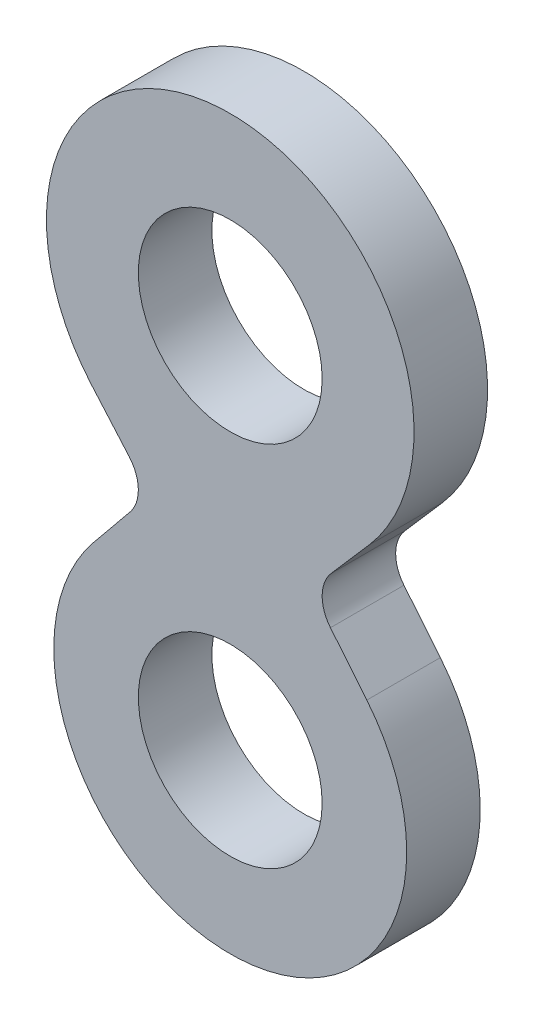
ISO-10303-21;
HEADER;
FILE_DESCRIPTION(('STEP AP214'),'2;1');
FILE_NAME('part.step','',(''),(''),'','','');
FILE_SCHEMA(('AUTOMOTIVE_DESIGN { 1 0 10303 214 1 1 1 1 }'));
ENDSEC;
DATA;
#1=APPLICATION_CONTEXT('core data for automotive mechanical design processes');
#2=APPLICATION_PROTOCOL_DEFINITION('international standard','automotive_design',2000,#1);
#3=PRODUCT_CONTEXT('',#1,'mechanical');
#4=PRODUCT('Part','Part','',(#3));
#5=PRODUCT_RELATED_PRODUCT_CATEGORY('part','',(#4));
#6=PRODUCT_DEFINITION_FORMATION('','',#4);
#7=PRODUCT_DEFINITION_CONTEXT('part definition',#1,'design');
#8=PRODUCT_DEFINITION('design','',#6,#7);
#9=PRODUCT_DEFINITION_SHAPE('','',#8);
#10=(LENGTH_UNIT() NAMED_UNIT(*) SI_UNIT(.MILLI.,.METRE.));
#11=(NAMED_UNIT(*) PLANE_ANGLE_UNIT() SI_UNIT($,.RADIAN.));
#12=(NAMED_UNIT(*) SI_UNIT($,.STERADIAN.) SOLID_ANGLE_UNIT());
#13=UNCERTAINTY_MEASURE_WITH_UNIT(LENGTH_MEASURE(1.E-05),#10,'distance_accuracy_value','');
#14=(GEOMETRIC_REPRESENTATION_CONTEXT(3) GLOBAL_UNCERTAINTY_ASSIGNED_CONTEXT((#13)) GLOBAL_UNIT_ASSIGNED_CONTEXT((#10,
#11,#12)) REPRESENTATION_CONTEXT('',''));
#15=CARTESIAN_POINT('',(0.,0.,0.));
#16=DIRECTION('',(0.,0.,1.));
#17=DIRECTION('',(1.,0.,0.));
#18=AXIS2_PLACEMENT_3D('',#15,#16,#17);
#19=CARTESIAN_POINT('',(0.,0.,12.7));
#20=DIRECTION('',(0.,0.,1.));
#21=DIRECTION('',(1.,0.,0.));
#22=AXIS2_PLACEMENT_3D('',#19,#20,#21);
#23=PLANE('',#22);
#24=CARTESIAN_POINT('',(0.,0.,12.7));
#25=DIRECTION('',(0.,0.,1.));
#26=DIRECTION('',(1.,0.,0.));
#27=AXIS2_PLACEMENT_3D('',#24,#25,#26);
#28=CIRCLE('',#27,15.875);
#29=CARTESIAN_POINT('',(15.875,0.,12.7));
#30=VERTEX_POINT('',#29);
#31=EDGE_CURVE('E140',#30,#30,#28,.T.);
#32=ORIENTED_EDGE('',*,*,#31,.F.);
#33=EDGE_LOOP('',(#32));
#34=FACE_BOUND('',#33,.T.);
#35=CARTESIAN_POINT('',(0.,0.,12.7));
#36=DIRECTION('',(0.,0.,1.));
#37=DIRECTION('',(1.,0.,0.));
#38=AXIS2_PLACEMENT_3D('',#35,#36,#37);
#39=CIRCLE('',#38,30.48);
#40=CARTESIAN_POINT('',(-23.5941386806436,19.2962954972854,12.7));
#41=VERTEX_POINT('',#40);
#42=CARTESIAN_POINT('',(23.5941386806436,19.2962954972854,12.7));
#43=VERTEX_POINT('',#42);
#44=EDGE_CURVE('E151',#41,#43,#39,.T.);
#45=ORIENTED_EDGE('',*,*,#44,.T.);
#46=DIRECTION('',(-0.633080560934561,0.774085914719278,0.));
#47=VECTOR('',#46,1.);
#48=CARTESIAN_POINT('',(17.3095544415326,26.9806384380655,12.7));
#49=LINE('',#48,#47);
#50=CARTESIAN_POINT('',(17.3095544415326,26.9806384380655,12.7));
#51=VERTEX_POINT('',#50);
#52=EDGE_CURVE('E99',#43,#51,#49,.T.);
#53=ORIENTED_EDGE('',*,*,#52,.T.);
#54=CARTESIAN_POINT('',(22.225,31.0007,12.7));
#55=DIRECTION('',(0.,0.,-1.));
#56=DIRECTION('',(1.,0.,0.));
#57=AXIS2_PLACEMENT_3D('',#54,#55,#56);
#58=CIRCLE('',#57,6.35);
#59=CARTESIAN_POINT('',(17.4347415045666,35.1691437799889,12.7));
#60=VERTEX_POINT('',#59);
#61=EDGE_CURVE('E166',#51,#60,#58,.T.);
#62=ORIENTED_EDGE('',*,*,#61,.T.);
#63=DIRECTION('',(0.656447839368324,0.754371416603691,0.));
#64=VECTOR('',#63,1.);
#65=CARTESIAN_POINT('',(17.4347415045666,35.1691437799889,12.7));
#66=LINE('',#65,#64);
#67=CARTESIAN_POINT('',(23.9512924771672,42.6577811000557,12.7));
#68=VERTEX_POINT('',#67);
#69=EDGE_CURVE('E179',#60,#68,#66,.T.);
#70=ORIENTED_EDGE('',*,*,#69,.T.);
#71=CARTESIAN_POINT('',(0.,63.5,12.7));
#72=DIRECTION('',(0.,0.,1.));
#73=DIRECTION('',(1.,0.,0.));
#74=AXIS2_PLACEMENT_3D('',#71,#72,#73);
#75=CIRCLE('',#74,31.75);
#76=CARTESIAN_POINT('',(-23.9512924771672,42.6577811000557,12.7));
#77=VERTEX_POINT('',#76);
#78=EDGE_CURVE('E118',#68,#77,#75,.T.);
#79=ORIENTED_EDGE('',*,*,#78,.T.);
#80=DIRECTION('',(0.656447839368324,-0.754371416603691,0.));
#81=VECTOR('',#80,1.);
#82=CARTESIAN_POINT('',(-17.4347415045666,35.1691437799889,12.7));
#83=LINE('',#82,#81);
#84=CARTESIAN_POINT('',(-17.4347415045666,35.1691437799889,12.7));
#85=VERTEX_POINT('',#84);
#86=EDGE_CURVE('E112',#77,#85,#83,.T.);
#87=ORIENTED_EDGE('',*,*,#86,.T.);
#88=CARTESIAN_POINT('',(-22.225,31.0007,12.7));
#89=DIRECTION('',(0.,0.,-1.));
#90=DIRECTION('',(1.,0.,0.));
#91=AXIS2_PLACEMENT_3D('',#88,#89,#90);
#92=CIRCLE('',#91,6.35);
#93=CARTESIAN_POINT('',(-17.3095544415326,26.9806384380655,12.7));
#94=VERTEX_POINT('',#93);
#95=EDGE_CURVE('E116',#85,#94,#92,.T.);
#96=ORIENTED_EDGE('',*,*,#95,.T.);
#97=DIRECTION('',(-0.633080560934561,-0.774085914719278,0.));
#98=VECTOR('',#97,1.);
#99=CARTESIAN_POINT('',(-23.5941386806436,19.2962954972854,12.7));
#100=LINE('',#99,#98);
#101=EDGE_CURVE('E56',#94,#41,#100,.T.);
#102=ORIENTED_EDGE('',*,*,#101,.T.);
#103=EDGE_LOOP('',(#45,#53,#62,#70,#79,#87,#96,#102));
#104=FACE_BOUND('',#103,.T.);
#105=CARTESIAN_POINT('',(0.,63.5,12.7));
#106=DIRECTION('',(0.,0.,1.));
#107=DIRECTION('',(1.,0.,0.));
#108=AXIS2_PLACEMENT_3D('',#105,#106,#107);
#109=CIRCLE('',#108,15.875);
#110=CARTESIAN_POINT('',(15.875,63.5,12.7));
#111=VERTEX_POINT('',#110);
#112=EDGE_CURVE('E188',#111,#111,#109,.T.);
#113=ORIENTED_EDGE('',*,*,#112,.F.);
#114=EDGE_LOOP('',(#113));
#115=FACE_BOUND('',#114,.T.);
#116=ADVANCED_FACE('F39',(#34,#104,#115),#23,.T.);
#117=CARTESIAN_POINT('',(0.,0.,0.));
#118=DIRECTION('',(0.,0.,1.));
#119=DIRECTION('',(1.,0.,0.));
#120=AXIS2_PLACEMENT_3D('',#117,#118,#119);
#121=PLANE('',#120);
#122=CARTESIAN_POINT('',(0.,0.,0.));
#123=DIRECTION('',(0.,0.,1.));
#124=DIRECTION('',(1.,0.,0.));
#125=AXIS2_PLACEMENT_3D('',#122,#123,#124);
#126=CIRCLE('',#125,30.48);
#127=CARTESIAN_POINT('',(-23.5941386806436,19.2962954972854,0.));
#128=VERTEX_POINT('',#127);
#129=CARTESIAN_POINT('',(23.5941386806436,19.2962954972854,0.));
#130=VERTEX_POINT('',#129);
#131=EDGE_CURVE('E136',#128,#130,#126,.T.);
#132=ORIENTED_EDGE('',*,*,#131,.F.);
#133=DIRECTION('',(-0.633080560934561,-0.774085914719278,0.));
#134=VECTOR('',#133,1.);
#135=CARTESIAN_POINT('',(-23.5941386806436,19.2962954972854,0.));
#136=LINE('',#135,#134);
#137=CARTESIAN_POINT('',(-17.3095544415326,26.9806384380655,0.));
#138=VERTEX_POINT('',#137);
#139=EDGE_CURVE('E91',#138,#128,#136,.T.);
#140=ORIENTED_EDGE('',*,*,#139,.F.);
#141=CARTESIAN_POINT('',(-22.225,31.0007,0.));
#142=DIRECTION('',(0.,0.,-1.));
#143=DIRECTION('',(1.,0.,0.));
#144=AXIS2_PLACEMENT_3D('',#141,#142,#143);
#145=CIRCLE('',#144,6.35);
#146=CARTESIAN_POINT('',(-17.4347415045666,35.1691437799889,0.));
#147=VERTEX_POINT('',#146);
#148=EDGE_CURVE('E85',#147,#138,#145,.T.);
#149=ORIENTED_EDGE('',*,*,#148,.F.);
#150=DIRECTION('',(0.656447839368324,-0.754371416603691,0.));
#151=VECTOR('',#150,1.);
#152=CARTESIAN_POINT('',(-17.4347415045666,35.1691437799889,0.));
#153=LINE('',#152,#151);
#154=CARTESIAN_POINT('',(-23.9512924771672,42.6577811000557,0.));
#155=VERTEX_POINT('',#154);
#156=EDGE_CURVE('E126',#155,#147,#153,.T.);
#157=ORIENTED_EDGE('',*,*,#156,.F.);
#158=CARTESIAN_POINT('',(0.,63.5,0.));
#159=DIRECTION('',(0.,0.,1.));
#160=DIRECTION('',(1.,0.,0.));
#161=AXIS2_PLACEMENT_3D('',#158,#159,#160);
#162=CIRCLE('',#161,31.75);
#163=CARTESIAN_POINT('',(23.9512924771672,42.6577811000557,0.));
#164=VERTEX_POINT('',#163);
#165=EDGE_CURVE('E146',#164,#155,#162,.T.);
#166=ORIENTED_EDGE('',*,*,#165,.F.);
#167=DIRECTION('',(0.656447839368324,0.754371416603691,0.));
#168=VECTOR('',#167,1.);
#169=CARTESIAN_POINT('',(17.4347415045666,35.1691437799889,0.));
#170=LINE('',#169,#168);
#171=CARTESIAN_POINT('',(17.4347415045666,35.1691437799889,0.));
#172=VERTEX_POINT('',#171);
#173=EDGE_CURVE('E144',#172,#164,#170,.T.);
#174=ORIENTED_EDGE('',*,*,#173,.F.);
#175=CARTESIAN_POINT('',(22.225,31.0007,0.));
#176=DIRECTION('',(0.,0.,-1.));
#177=DIRECTION('',(1.,0.,0.));
#178=AXIS2_PLACEMENT_3D('',#175,#176,#177);
#179=CIRCLE('',#178,6.35);
#180=CARTESIAN_POINT('',(17.3095544415326,26.9806384380655,0.));
#181=VERTEX_POINT('',#180);
#182=EDGE_CURVE('E142',#181,#172,#179,.T.);
#183=ORIENTED_EDGE('',*,*,#182,.F.);
#184=DIRECTION('',(-0.633080560934561,0.774085914719278,0.));
#185=VECTOR('',#184,1.);
#186=CARTESIAN_POINT('',(17.3095544415326,26.9806384380655,0.));
#187=LINE('',#186,#185);
#188=EDGE_CURVE('E139',#130,#181,#187,.T.);
#189=ORIENTED_EDGE('',*,*,#188,.F.);
#190=EDGE_LOOP('',(#132,#140,#149,#157,#166,#174,#183,#189));
#191=FACE_BOUND('',#190,.T.);
#192=CARTESIAN_POINT('',(0.,0.,0.));
#193=DIRECTION('',(0.,0.,1.));
#194=DIRECTION('',(1.,0.,0.));
#195=AXIS2_PLACEMENT_3D('',#192,#193,#194);
#196=CIRCLE('',#195,15.875);
#197=CARTESIAN_POINT('',(15.875,0.,0.));
#198=VERTEX_POINT('',#197);
#199=EDGE_CURVE('E185',#198,#198,#196,.T.);
#200=ORIENTED_EDGE('',*,*,#199,.T.);
#201=EDGE_LOOP('',(#200));
#202=FACE_BOUND('',#201,.T.);
#203=CARTESIAN_POINT('',(0.,63.5,0.));
#204=DIRECTION('',(0.,0.,1.));
#205=DIRECTION('',(1.,0.,0.));
#206=AXIS2_PLACEMENT_3D('',#203,#204,#205);
#207=CIRCLE('',#206,15.875);
#208=CARTESIAN_POINT('',(15.875,63.5,0.));
#209=VERTEX_POINT('',#208);
#210=EDGE_CURVE('E191',#209,#209,#207,.T.);
#211=ORIENTED_EDGE('',*,*,#210,.T.);
#212=EDGE_LOOP('',(#211));
#213=FACE_BOUND('',#212,.T.);
#214=ADVANCED_FACE('F170',(#191,#202,#213),#121,.F.);
#215=CARTESIAN_POINT('',(0.,0.,12.7));
#216=DIRECTION('',(0.,0.,-1.));
#217=DIRECTION('',(-1.,0.,0.));
#218=AXIS2_PLACEMENT_3D('',#215,#216,#217);
#219=CYLINDRICAL_SURFACE('',#218,30.48);
#220=ORIENTED_EDGE('',*,*,#131,.T.);
#221=DIRECTION('',(0.,0.,-1.));
#222=VECTOR('',#221,1.);
#223=CARTESIAN_POINT('',(23.5941386806436,19.2962954972854,12.7));
#224=LINE('',#223,#222);
#225=EDGE_CURVE('E11',#43,#130,#224,.T.);
#226=ORIENTED_EDGE('',*,*,#225,.F.);
#227=ORIENTED_EDGE('',*,*,#44,.F.);
#228=DIRECTION('',(0.,0.,-1.));
#229=VECTOR('',#228,1.);
#230=CARTESIAN_POINT('',(-23.5941386806436,19.2962954972854,12.7));
#231=LINE('',#230,#229);
#232=EDGE_CURVE('E132',#41,#128,#231,.T.);
#233=ORIENTED_EDGE('',*,*,#232,.T.);
#234=EDGE_LOOP('',(#220,#226,#227,#233));
#235=FACE_BOUND('',#234,.T.);
#236=ADVANCED_FACE('F41',(#235),#219,.T.);
#237=CARTESIAN_POINT('',(17.3095544415326,26.9806384380655,12.7));
#238=DIRECTION('',(-0.774085914719278,-0.633080560934561,0.));
#239=DIRECTION('',(0.633080560934561,-0.774085914719278,0.));
#240=AXIS2_PLACEMENT_3D('',#237,#238,#239);
#241=PLANE('',#240);
#242=ORIENTED_EDGE('',*,*,#188,.T.);
#243=DIRECTION('',(0.,0.,-1.));
#244=VECTOR('',#243,1.);
#245=CARTESIAN_POINT('',(17.3095544415326,26.9806384380655,12.7));
#246=LINE('',#245,#244);
#247=EDGE_CURVE('E48',#51,#181,#246,.T.);
#248=ORIENTED_EDGE('',*,*,#247,.F.);
#249=ORIENTED_EDGE('',*,*,#52,.F.);
#250=ORIENTED_EDGE('',*,*,#225,.T.);
#251=EDGE_LOOP('',(#242,#248,#249,#250));
#252=FACE_BOUND('',#251,.T.);
#253=ADVANCED_FACE('F223',(#252),#241,.F.);
#254=CARTESIAN_POINT('',(22.225,31.0007,12.7));
#255=DIRECTION('',(0.,0.,-1.));
#256=DIRECTION('',(-1.,0.,0.));
#257=AXIS2_PLACEMENT_3D('',#254,#255,#256);
#258=CYLINDRICAL_SURFACE('',#257,6.35);
#259=ORIENTED_EDGE('',*,*,#182,.T.);
#260=DIRECTION('',(0.,0.,-1.));
#261=VECTOR('',#260,1.);
#262=CARTESIAN_POINT('',(17.4347415045666,35.1691437799889,12.7));
#263=LINE('',#262,#261);
#264=EDGE_CURVE('E158',#60,#172,#263,.T.);
#265=ORIENTED_EDGE('',*,*,#264,.F.);
#266=ORIENTED_EDGE('',*,*,#61,.F.);
#267=ORIENTED_EDGE('',*,*,#247,.T.);
#268=EDGE_LOOP('',(#259,#265,#266,#267));
#269=FACE_BOUND('',#268,.T.);
#270=ADVANCED_FACE('F164',(#269),#258,.F.);
#271=CARTESIAN_POINT('',(17.4347415045666,35.1691437799889,12.7));
#272=DIRECTION('',(-0.754371416603691,0.656447839368324,0.));
#273=DIRECTION('',(-0.656447839368324,-0.754371416603691,0.));
#274=AXIS2_PLACEMENT_3D('',#271,#272,#273);
#275=PLANE('',#274);
#276=ORIENTED_EDGE('',*,*,#173,.T.);
#277=DIRECTION('',(0.,0.,-1.));
#278=VECTOR('',#277,1.);
#279=CARTESIAN_POINT('',(23.9512924771672,42.6577811000557,12.7));
#280=LINE('',#279,#278);
#281=EDGE_CURVE('E155',#68,#164,#280,.T.);
#282=ORIENTED_EDGE('',*,*,#281,.F.);
#283=ORIENTED_EDGE('',*,*,#69,.F.);
#284=ORIENTED_EDGE('',*,*,#264,.T.);
#285=EDGE_LOOP('',(#276,#282,#283,#284));
#286=FACE_BOUND('',#285,.T.);
#287=ADVANCED_FACE('F175',(#286),#275,.F.);
#288=CARTESIAN_POINT('',(0.,63.5,12.7));
#289=DIRECTION('',(0.,0.,-1.));
#290=DIRECTION('',(-1.,0.,0.));
#291=AXIS2_PLACEMENT_3D('',#288,#289,#290);
#292=CYLINDRICAL_SURFACE('',#291,31.75);
#293=ORIENTED_EDGE('',*,*,#165,.T.);
#294=DIRECTION('',(0.,0.,-1.));
#295=VECTOR('',#294,1.);
#296=CARTESIAN_POINT('',(-23.9512924771672,42.6577811000557,12.7));
#297=LINE('',#296,#295);
#298=EDGE_CURVE('E127',#77,#155,#297,.T.);
#299=ORIENTED_EDGE('',*,*,#298,.F.);
#300=ORIENTED_EDGE('',*,*,#78,.F.);
#301=ORIENTED_EDGE('',*,*,#281,.T.);
#302=EDGE_LOOP('',(#293,#299,#300,#301));
#303=FACE_BOUND('',#302,.T.);
#304=ADVANCED_FACE('F178',(#303),#292,.T.);
#305=CARTESIAN_POINT('',(-17.4347415045666,35.1691437799889,12.7));
#306=DIRECTION('',(0.754371416603691,0.656447839368324,0.));
#307=DIRECTION('',(-0.656447839368324,0.754371416603691,0.));
#308=AXIS2_PLACEMENT_3D('',#305,#306,#307);
#309=PLANE('',#308);
#310=ORIENTED_EDGE('',*,*,#156,.T.);
#311=DIRECTION('',(0.,0.,-1.));
#312=VECTOR('',#311,1.);
#313=CARTESIAN_POINT('',(-17.4347415045666,35.1691437799889,12.7));
#314=LINE('',#313,#312);
#315=EDGE_CURVE('E123',#85,#147,#314,.T.);
#316=ORIENTED_EDGE('',*,*,#315,.F.);
#317=ORIENTED_EDGE('',*,*,#86,.F.);
#318=ORIENTED_EDGE('',*,*,#298,.T.);
#319=EDGE_LOOP('',(#310,#316,#317,#318));
#320=FACE_BOUND('',#319,.T.);
#321=ADVANCED_FACE('F124',(#320),#309,.F.);
#322=CARTESIAN_POINT('',(-22.225,31.0007,12.7));
#323=DIRECTION('',(0.,0.,-1.));
#324=DIRECTION('',(-1.,0.,0.));
#325=AXIS2_PLACEMENT_3D('',#322,#323,#324);
#326=CYLINDRICAL_SURFACE('',#325,6.35);
#327=ORIENTED_EDGE('',*,*,#148,.T.);
#328=DIRECTION('',(0.,0.,-1.));
#329=VECTOR('',#328,1.);
#330=CARTESIAN_POINT('',(-17.3095544415326,26.9806384380655,12.7));
#331=LINE('',#330,#329);
#332=EDGE_CURVE('E128',#94,#138,#331,.T.);
#333=ORIENTED_EDGE('',*,*,#332,.F.);
#334=ORIENTED_EDGE('',*,*,#95,.F.);
#335=ORIENTED_EDGE('',*,*,#315,.T.);
#336=EDGE_LOOP('',(#327,#333,#334,#335));
#337=FACE_BOUND('',#336,.T.);
#338=ADVANCED_FACE('F130',(#337),#326,.F.);
#339=CARTESIAN_POINT('',(-23.5941386806436,19.2962954972854,12.7));
#340=DIRECTION('',(0.774085914719278,-0.633080560934561,0.));
#341=DIRECTION('',(0.633080560934561,0.774085914719278,0.));
#342=AXIS2_PLACEMENT_3D('',#339,#340,#341);
#343=PLANE('',#342);
#344=ORIENTED_EDGE('',*,*,#139,.T.);
#345=ORIENTED_EDGE('',*,*,#232,.F.);
#346=ORIENTED_EDGE('',*,*,#101,.F.);
#347=ORIENTED_EDGE('',*,*,#332,.T.);
#348=EDGE_LOOP('',(#344,#345,#346,#347));
#349=FACE_BOUND('',#348,.T.);
#350=ADVANCED_FACE('F211',(#349),#343,.F.);
#351=CARTESIAN_POINT('',(0.,0.,12.7));
#352=DIRECTION('',(0.,0.,-1.));
#353=DIRECTION('',(-1.,0.,0.));
#354=AXIS2_PLACEMENT_3D('',#351,#352,#353);
#355=CYLINDRICAL_SURFACE('',#354,15.875);
#356=ORIENTED_EDGE('',*,*,#31,.T.);
#357=EDGE_LOOP('',(#356));
#358=FACE_BOUND('',#357,.T.);
#359=ORIENTED_EDGE('',*,*,#199,.F.);
#360=EDGE_LOOP('',(#359));
#361=FACE_BOUND('',#360,.T.);
#362=ADVANCED_FACE('F208',(#358,#361),#355,.F.);
#363=CARTESIAN_POINT('',(0.,63.5,12.7));
#364=DIRECTION('',(0.,0.,-1.));
#365=DIRECTION('',(-1.,0.,0.));
#366=AXIS2_PLACEMENT_3D('',#363,#364,#365);
#367=CYLINDRICAL_SURFACE('',#366,15.875);
#368=ORIENTED_EDGE('',*,*,#112,.T.);
#369=EDGE_LOOP('',(#368));
#370=FACE_BOUND('',#369,.T.);
#371=ORIENTED_EDGE('',*,*,#210,.F.);
#372=EDGE_LOOP('',(#371));
#373=FACE_BOUND('',#372,.T.);
#374=ADVANCED_FACE('F197',(#370,#373),#367,.F.);
#375=CLOSED_SHELL('',(#116,#214,#236,#253,#270,#287,#304,#321,#338,#350,#362,#374));
#376=MANIFOLD_SOLID_BREP('B2',#375);
#377=ADVANCED_BREP_SHAPE_REPRESENTATION('',(#18,#376),#14);
#378=SHAPE_DEFINITION_REPRESENTATION(#9,#377);
ENDSEC;
END-ISO-10303-21;
